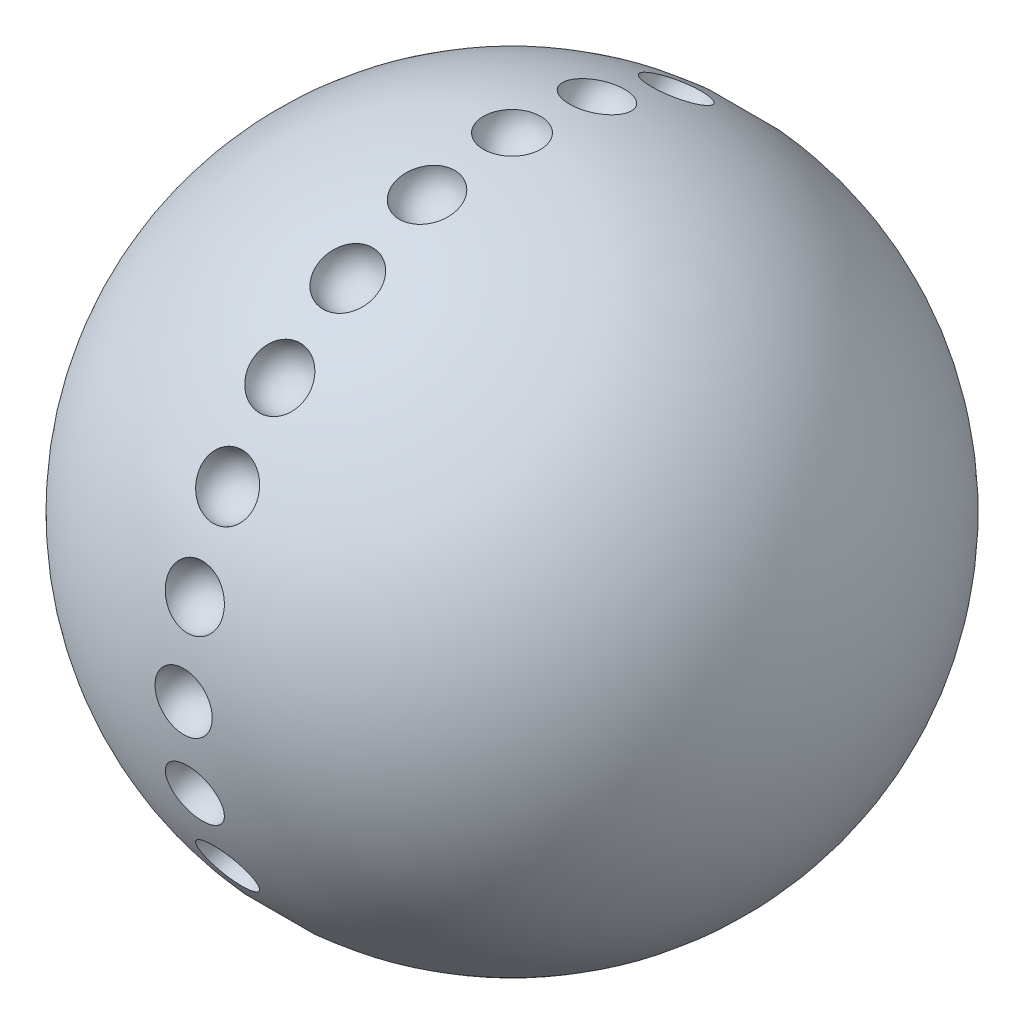
ISO-10303-21;
HEADER;
FILE_DESCRIPTION(('STEP AP214'),'2;1');
FILE_NAME('part.step','',(''),(''),'','','');
FILE_SCHEMA(('AUTOMOTIVE_DESIGN { 1 0 10303 214 1 1 1 1 }'));
ENDSEC;
DATA;
#1=APPLICATION_CONTEXT('core data for automotive mechanical design processes');
#2=APPLICATION_PROTOCOL_DEFINITION('international standard','automotive_design',2000,#1);
#3=PRODUCT_CONTEXT('',#1,'mechanical');
#4=PRODUCT('Part','Part','',(#3));
#5=PRODUCT_RELATED_PRODUCT_CATEGORY('part','',(#4));
#6=PRODUCT_DEFINITION_FORMATION('','',#4);
#7=PRODUCT_DEFINITION_CONTEXT('part definition',#1,'design');
#8=PRODUCT_DEFINITION('design','',#6,#7);
#9=PRODUCT_DEFINITION_SHAPE('','',#8);
#10=(LENGTH_UNIT() NAMED_UNIT(*) SI_UNIT(.MILLI.,.METRE.));
#11=(NAMED_UNIT(*) PLANE_ANGLE_UNIT() SI_UNIT($,.RADIAN.));
#12=(NAMED_UNIT(*) SI_UNIT($,.STERADIAN.) SOLID_ANGLE_UNIT());
#13=UNCERTAINTY_MEASURE_WITH_UNIT(LENGTH_MEASURE(1.E-05),#10,'distance_accuracy_value','');
#14=(GEOMETRIC_REPRESENTATION_CONTEXT(3) GLOBAL_UNCERTAINTY_ASSIGNED_CONTEXT((#13)) GLOBAL_UNIT_ASSIGNED_CONTEXT((#10,
#11,#12)) REPRESENTATION_CONTEXT('',''));
#15=CARTESIAN_POINT('',(0.,0.,0.));
#16=DIRECTION('',(0.,0.,1.));
#17=DIRECTION('',(1.,0.,0.));
#18=AXIS2_PLACEMENT_3D('',#15,#16,#17);
#19=CARTESIAN_POINT('',(0.,0.,0.));
#20=DIRECTION('',(0.,1.,0.));
#21=DIRECTION('',(1.,0.,0.));
#22=AXIS2_PLACEMENT_3D('',#19,#20,#21);
#23=SPHERICAL_SURFACE('',#22,77.4494445270297);
#24=CARTESIAN_POINT('',(0.,-19.9696423745412,-74.5277199507723));
#25=DIRECTION('',(0.,-0.258819045102508,-0.965925826289072));
#26=DIRECTION('',(0.,0.965925826289072,-0.258819045102508));
#27=AXIS2_PLACEMENT_3D('',#24,#25,#26);
#28=CIRCLE('',#27,6.72672282152599);
#29=CARTESIAN_POINT('',(0.,-13.4721270749412,-76.2687239281089));
#30=VERTEX_POINT('',#29);
#31=EDGE_CURVE('E40',#30,#30,#28,.F.);
#32=ORIENTED_EDGE('',*,*,#31,.T.);
#33=EDGE_LOOP('',(#32));
#34=FACE_BOUND('',#33,.T.);
#35=CARTESIAN_POINT('',(0.,-38.578386622653,-66.8197257044724));
#36=DIRECTION('',(0.,-0.499999999999989,-0.866025403784445));
#37=DIRECTION('',(0.,0.866025403784445,-0.499999999999989));
#38=AXIS2_PLACEMENT_3D('',#35,#36,#37);
#39=CIRCLE('',#38,6.72672282152599);
#40=CARTESIAN_POINT('',(0.,-32.7528737749949,-70.1830871152353));
#41=VERTEX_POINT('',#40);
#42=EDGE_CURVE('E132',#41,#41,#39,.F.);
#43=ORIENTED_EDGE('',*,*,#42,.T.);
#44=EDGE_LOOP('',(#43));
#45=FACE_BOUND('',#44,.T.);
#46=CARTESIAN_POINT('',(0.,-54.5580775762291,-54.5580775762305));
#47=DIRECTION('',(0.,-0.707106781186539,-0.707106781186556));
#48=DIRECTION('',(0.,0.707106781186556,-0.707106781186539));
#49=AXIS2_PLACEMENT_3D('',#46,#47,#48);
#50=CIRCLE('',#49,6.72672282152599);
#51=CARTESIAN_POINT('',(0.,-49.8015662539658,-59.3145888984937));
#52=VERTEX_POINT('',#51);
#53=EDGE_CURVE('E129',#52,#52,#50,.F.);
#54=ORIENTED_EDGE('',*,*,#53,.T.);
#55=EDGE_LOOP('',(#54));
#56=FACE_BOUND('',#55,.T.);
#57=CARTESIAN_POINT('',(0.,-66.8197257044715,-38.5783866226546));
#58=DIRECTION('',(0.,-0.866025403784433,-0.50000000000001));
#59=DIRECTION('',(0.,0.50000000000001,-0.866025403784433));
#60=AXIS2_PLACEMENT_3D('',#57,#58,#59);
#61=CIRCLE('',#60,6.72672282152599);
#62=CARTESIAN_POINT('',(0.,-63.4563642937084,-44.4038994703126));
#63=VERTEX_POINT('',#62);
#64=EDGE_CURVE('E125',#63,#63,#61,.F.);
#65=ORIENTED_EDGE('',*,*,#64,.T.);
#66=EDGE_LOOP('',(#65));
#67=FACE_BOUND('',#66,.T.);
#68=CARTESIAN_POINT('',(0.,-74.5277199507718,-19.9696423745431));
#69=DIRECTION('',(0.,-0.965925826289065,-0.258819045102531));
#70=DIRECTION('',(0.,0.258819045102532,-0.965925826289066));
#71=AXIS2_PLACEMENT_3D('',#68,#69,#70);
#72=CIRCLE('',#71,6.72672282152599);
#73=CARTESIAN_POINT('',(0.,-72.7867159734351,-26.4671576741431));
#74=VERTEX_POINT('',#73);
#75=EDGE_CURVE('E121',#74,#74,#72,.F.);
#76=ORIENTED_EDGE('',*,*,#75,.T.);
#77=EDGE_LOOP('',(#76));
#78=FACE_BOUND('',#77,.T.);
#79=CARTESIAN_POINT('',(0.,-77.1567732453076,-8.08174301854028E-13));
#80=DIRECTION('',(0.,-1.,0.));
#81=DIRECTION('',(0.,0.,-1.));
#82=AXIS2_PLACEMENT_3D('',#79,#80,#81);
#83=CIRCLE('',#82,6.72672282152599);
#84=CARTESIAN_POINT('',(0.,-77.1567732453075,-6.7267228215268));
#85=VERTEX_POINT('',#84);
#86=EDGE_CURVE('E117',#85,#85,#83,.F.);
#87=ORIENTED_EDGE('',*,*,#86,.T.);
#88=EDGE_LOOP('',(#87));
#89=FACE_BOUND('',#88,.T.);
#90=CARTESIAN_POINT('',(0.,-74.5277199507723,19.9696423745415));
#91=DIRECTION('',(0.,-0.965925826289071,0.258819045102511));
#92=DIRECTION('',(0.,-0.258819045102511,-0.965925826289071));
#93=AXIS2_PLACEMENT_3D('',#90,#91,#92);
#94=CIRCLE('',#93,6.72672282152599);
#95=CARTESIAN_POINT('',(0.,-76.2687239281089,13.4721270749415));
#96=VERTEX_POINT('',#95);
#97=EDGE_CURVE('E113',#96,#96,#94,.F.);
#98=ORIENTED_EDGE('',*,*,#97,.T.);
#99=EDGE_LOOP('',(#98));
#100=FACE_BOUND('',#99,.T.);
#101=CARTESIAN_POINT('',(0.,-66.8197257044723,38.5783866226532));
#102=DIRECTION('',(0.,-0.866025403784443,0.499999999999992));
#103=DIRECTION('',(0.,-0.499999999999992,-0.866025403784443));
#104=AXIS2_PLACEMENT_3D('',#101,#102,#103);
#105=CIRCLE('',#104,6.72672282152599);
#106=CARTESIAN_POINT('',(0.,-70.1830871152352,32.7528737749951));
#107=VERTEX_POINT('',#106);
#108=EDGE_CURVE('E109',#107,#107,#105,.F.);
#109=ORIENTED_EDGE('',*,*,#108,.T.);
#110=EDGE_LOOP('',(#109));
#111=FACE_BOUND('',#110,.T.);
#112=CARTESIAN_POINT('',(0.,-54.5580775762303,54.5580775762293));
#113=DIRECTION('',(0.,-0.707106781186554,0.707106781186541));
#114=DIRECTION('',(0.,-0.707106781186541,-0.707106781186554));
#115=AXIS2_PLACEMENT_3D('',#112,#113,#114);
#116=CIRCLE('',#115,6.72672282152599);
#117=CARTESIAN_POINT('',(0.,-59.3145888984936,49.801566253966));
#118=VERTEX_POINT('',#117);
#119=EDGE_CURVE('E105',#118,#118,#116,.F.);
#120=ORIENTED_EDGE('',*,*,#119,.T.);
#121=EDGE_LOOP('',(#120));
#122=FACE_BOUND('',#121,.T.);
#123=CARTESIAN_POINT('',(0.,-38.5783866226543,66.8197257044716));
#124=DIRECTION('',(0.,-0.500000000000007,0.866025403784434));
#125=DIRECTION('',(0.,-0.866025403784435,-0.500000000000007));
#126=AXIS2_PLACEMENT_3D('',#123,#124,#125);
#127=CIRCLE('',#126,6.72672282152612);
#128=CARTESIAN_POINT('',(0.,-44.4038994703125,63.4563642937085));
#129=VERTEX_POINT('',#128);
#130=EDGE_CURVE('E101',#129,#129,#127,.F.);
#131=ORIENTED_EDGE('',*,*,#130,.T.);
#132=EDGE_LOOP('',(#131));
#133=FACE_BOUND('',#132,.T.);
#134=CARTESIAN_POINT('',(0.,-19.9696423745428,74.5277199507719));
#135=DIRECTION('',(0.,-0.258819045102528,0.965925826289066));
#136=DIRECTION('',(0.,-0.965925826289066,-0.258819045102528));
#137=AXIS2_PLACEMENT_3D('',#134,#135,#136);
#138=CIRCLE('',#137,6.72672282152599);
#139=CARTESIAN_POINT('',(0.,-26.4671576741428,72.7867159734351));
#140=VERTEX_POINT('',#139);
#141=EDGE_CURVE('E97',#140,#140,#138,.F.);
#142=ORIENTED_EDGE('',*,*,#141,.T.);
#143=EDGE_LOOP('',(#142));
#144=FACE_BOUND('',#143,.T.);
#145=CARTESIAN_POINT('',(0.,0.,77.1567732453076));
#146=DIRECTION('',(0.,0.,1.));
#147=DIRECTION('',(1.,0.,0.));
#148=AXIS2_PLACEMENT_3D('',#145,#146,#147);
#149=CIRCLE('',#148,6.72672282152599);
#150=CARTESIAN_POINT('',(6.72672282152599,0.,77.1567732453076));
#151=VERTEX_POINT('',#150);
#152=EDGE_CURVE('E93',#151,#151,#149,.F.);
#153=ORIENTED_EDGE('',*,*,#152,.T.);
#154=EDGE_LOOP('',(#153));
#155=FACE_BOUND('',#154,.T.);
#156=CARTESIAN_POINT('',(0.,19.9696423745418,74.5277199507722));
#157=DIRECTION('',(0.,0.258819045102515,0.96592582628907));
#158=DIRECTION('',(0.,-0.96592582628907,0.258819045102515));
#159=AXIS2_PLACEMENT_3D('',#156,#157,#158);
#160=CIRCLE('',#159,6.72672282152599);
#161=CARTESIAN_POINT('',(0.,13.4721270749417,76.2687239281088));
#162=VERTEX_POINT('',#161);
#163=EDGE_CURVE('E89',#162,#162,#160,.F.);
#164=ORIENTED_EDGE('',*,*,#163,.T.);
#165=EDGE_LOOP('',(#164));
#166=FACE_BOUND('',#165,.T.);
#167=CARTESIAN_POINT('',(0.,38.5783866226534,66.8197257044721));
#168=DIRECTION('',(0.,0.499999999999995,0.866025403784442));
#169=DIRECTION('',(0.,-0.866025403784442,0.499999999999995));
#170=AXIS2_PLACEMENT_3D('',#167,#168,#169);
#171=CIRCLE('',#170,6.72672282152599);
#172=CARTESIAN_POINT('',(0.,32.7528737749954,70.1830871152351));
#173=VERTEX_POINT('',#172);
#174=EDGE_CURVE('E85',#173,#173,#171,.F.);
#175=ORIENTED_EDGE('',*,*,#174,.T.);
#176=EDGE_LOOP('',(#175));
#177=FACE_BOUND('',#176,.T.);
#178=CARTESIAN_POINT('',(0.,54.5580775762295,54.5580775762301));
#179=DIRECTION('',(0.,0.707106781186544,0.707106781186551));
#180=DIRECTION('',(0.,-0.707106781186551,0.707106781186544));
#181=AXIS2_PLACEMENT_3D('',#178,#179,#180);
#182=CIRCLE('',#181,6.72672282152599);
#183=CARTESIAN_POINT('',(0.,49.8015662539662,59.3145888984934));
#184=VERTEX_POINT('',#183);
#185=EDGE_CURVE('E81',#184,#184,#182,.F.);
#186=ORIENTED_EDGE('',*,*,#185,.T.);
#187=EDGE_LOOP('',(#186));
#188=FACE_BOUND('',#187,.T.);
#189=CARTESIAN_POINT('',(0.,66.8197257044717,38.5783866226541));
#190=DIRECTION('',(0.,0.866025403784436,0.500000000000004));
#191=DIRECTION('',(0.,-0.500000000000004,0.866025403784436));
#192=AXIS2_PLACEMENT_3D('',#189,#190,#191);
#193=CIRCLE('',#192,6.72672282152612);
#194=CARTESIAN_POINT('',(0.,63.4563642937086,44.4038994703122));
#195=VERTEX_POINT('',#194);
#196=EDGE_CURVE('E77',#195,#195,#193,.F.);
#197=ORIENTED_EDGE('',*,*,#196,.T.);
#198=EDGE_LOOP('',(#197));
#199=FACE_BOUND('',#198,.T.);
#200=CARTESIAN_POINT('',(0.,74.5277199507719,19.9696423745425));
#201=DIRECTION('',(0.,0.965925826289067,0.258819045102525));
#202=DIRECTION('',(0.,-0.258819045102525,0.965925826289067));
#203=AXIS2_PLACEMENT_3D('',#200,#201,#202);
#204=CIRCLE('',#203,6.72672282152612);
#205=CARTESIAN_POINT('',(0.,72.7867159734352,26.4671576741427));
#206=VERTEX_POINT('',#205);
#207=EDGE_CURVE('E73',#206,#206,#204,.F.);
#208=ORIENTED_EDGE('',*,*,#207,.T.);
#209=EDGE_LOOP('',(#208));
#210=FACE_BOUND('',#209,.T.);
#211=CARTESIAN_POINT('',(0.,77.1567732453076,2.69391433951343E-13));
#212=DIRECTION('',(0.,1.,0.));
#213=DIRECTION('',(0.,0.,1.));
#214=AXIS2_PLACEMENT_3D('',#211,#212,#213);
#215=CIRCLE('',#214,6.72672282152599);
#216=CARTESIAN_POINT('',(0.,77.1567732453076,6.72672282152626));
#217=VERTEX_POINT('',#216);
#218=EDGE_CURVE('E69',#217,#217,#215,.F.);
#219=ORIENTED_EDGE('',*,*,#218,.T.);
#220=EDGE_LOOP('',(#219));
#221=FACE_BOUND('',#220,.T.);
#222=CARTESIAN_POINT('',(0.,74.5277199507721,-19.969642374542));
#223=DIRECTION('',(0.,0.965925826289069,-0.258819045102518));
#224=DIRECTION('',(0.,0.258819045102518,0.965925826289069));
#225=AXIS2_PLACEMENT_3D('',#222,#223,#224);
#226=CIRCLE('',#225,6.72672282152612);
#227=CARTESIAN_POINT('',(0.,76.2687239281088,-13.4721270749419));
#228=VERTEX_POINT('',#227);
#229=EDGE_CURVE('E65',#228,#228,#226,.F.);
#230=ORIENTED_EDGE('',*,*,#229,.T.);
#231=EDGE_LOOP('',(#230));
#232=FACE_BOUND('',#231,.T.);
#233=CARTESIAN_POINT('',(0.,66.819725704472,-38.5783866226537));
#234=DIRECTION('',(0.,0.86602540378444,-0.499999999999998));
#235=DIRECTION('',(0.,0.499999999999998,0.86602540378444));
#236=AXIS2_PLACEMENT_3D('',#233,#234,#235);
#237=CIRCLE('',#236,6.72672282152599);
#238=CARTESIAN_POINT('',(0.,70.183087115235,-32.7528737749956));
#239=VERTEX_POINT('',#238);
#240=EDGE_CURVE('E61',#239,#239,#237,.F.);
#241=ORIENTED_EDGE('',*,*,#240,.T.);
#242=EDGE_LOOP('',(#241));
#243=FACE_BOUND('',#242,.T.);
#244=CARTESIAN_POINT('',(0.,54.5580775762299,-54.5580775762297));
#245=DIRECTION('',(0.,0.707106781186549,-0.707106781186546));
#246=DIRECTION('',(0.,0.707106781186546,0.707106781186549));
#247=AXIS2_PLACEMENT_3D('',#244,#245,#246);
#248=CIRCLE('',#247,6.72672282152599);
#249=CARTESIAN_POINT('',(0.,59.3145888984932,-49.8015662539664));
#250=VERTEX_POINT('',#249);
#251=EDGE_CURVE('E57',#250,#250,#248,.F.);
#252=ORIENTED_EDGE('',*,*,#251,.T.);
#253=EDGE_LOOP('',(#252));
#254=FACE_BOUND('',#253,.T.);
#255=CARTESIAN_POINT('',(0.,38.5783866226539,-66.8197257044718));
#256=DIRECTION('',(0.,0.500000000000001,-0.866025403784438));
#257=DIRECTION('',(0.,0.866025403784438,0.500000000000001));
#258=AXIS2_PLACEMENT_3D('',#255,#256,#257);
#259=CIRCLE('',#258,6.72672282152599);
#260=CARTESIAN_POINT('',(0.,44.4038994703119,-63.4563642937089));
#261=VERTEX_POINT('',#260);
#262=EDGE_CURVE('E51',#261,#261,#259,.F.);
#263=ORIENTED_EDGE('',*,*,#262,.T.);
#264=EDGE_LOOP('',(#263));
#265=FACE_BOUND('',#264,.T.);
#266=CARTESIAN_POINT('',(0.,19.9696423745423,-74.527719950772));
#267=DIRECTION('',(0.,0.258819045102521,-0.965925826289068));
#268=DIRECTION('',(0.,0.965925826289068,0.258819045102521));
#269=AXIS2_PLACEMENT_3D('',#266,#267,#268);
#270=CIRCLE('',#269,6.72672282152599);
#271=CARTESIAN_POINT('',(0.,26.4671576741423,-72.7867159734353));
#272=VERTEX_POINT('',#271);
#273=EDGE_CURVE('E45',#272,#272,#270,.F.);
#274=ORIENTED_EDGE('',*,*,#273,.T.);
#275=EDGE_LOOP('',(#274));
#276=FACE_BOUND('',#275,.T.);
#277=CARTESIAN_POINT('',(0.,0.,-77.1567732453076));
#278=DIRECTION('',(0.,0.,-1.));
#279=DIRECTION('',(-1.,0.,0.));
#280=AXIS2_PLACEMENT_3D('',#277,#278,#279);
#281=CIRCLE('',#280,6.72672282152599);
#282=CARTESIAN_POINT('',(-6.72672282152599,0.,-77.1567732453076));
#283=VERTEX_POINT('',#282);
#284=EDGE_CURVE('E10',#283,#283,#281,.F.);
#285=ORIENTED_EDGE('',*,*,#284,.T.);
#286=EDGE_LOOP('',(#285));
#287=FACE_BOUND('',#286,.T.);
#288=ADVANCED_FACE('F37',(#34,#45,#56,#67,#78,#89,#100,#111,#122,#133,#144,#155,#166,#177,#188,
#199,#210,#221,#232,#243,#254,#265,#276,#287),#23,.T.);
#289=CARTESIAN_POINT('',(0.,0.,-77.4494445270297));
#290=DIRECTION('',(-1.,0.,0.));
#291=DIRECTION('',(0.,0.,-1.));
#292=AXIS2_PLACEMENT_3D('',#289,#290,#291);
#293=SPHERICAL_SURFACE('',#292,6.73308669161355);
#294=CARTESIAN_POINT('',(0.,0.,-77.4494445270297));
#295=DIRECTION('',(0.,0.,-1.));
#296=DIRECTION('',(-1.,0.,0.));
#297=AXIS2_PLACEMENT_3D('',#294,#295,#296);
#298=SPHERICAL_SURFACE('',#297,6.73308669161355);
#299=ORIENTED_EDGE('',*,*,#284,.F.);
#300=EDGE_LOOP('',(#299));
#301=FACE_BOUND('',#300,.T.);
#302=ADVANCED_FACE('F153',(#301),#298,.F.);
#303=CARTESIAN_POINT('',(0.,20.0453912762065,-74.8104187004005));
#304=DIRECTION('',(-1.,0.,0.));
#305=DIRECTION('',(0.,0.258819045102521,-0.965925826289068));
#306=AXIS2_PLACEMENT_3D('',#303,#304,#305);
#307=SPHERICAL_SURFACE('',#306,6.73308669161355);
#308=CARTESIAN_POINT('',(0.,20.0453912762065,-74.8104187004005));
#309=DIRECTION('',(0.,0.258819045102521,-0.965925826289068));
#310=DIRECTION('',(0.,0.965925826289068,0.258819045102521));
#311=AXIS2_PLACEMENT_3D('',#308,#309,#310);
#312=SPHERICAL_SURFACE('',#311,6.73308669161355);
#313=ORIENTED_EDGE('',*,*,#273,.F.);
#314=EDGE_LOOP('',(#313));
#315=FACE_BOUND('',#314,.T.);
#316=ADVANCED_FACE('F157',(#315),#312,.F.);
#317=CARTESIAN_POINT('',(0.,38.7247222635149,-67.0731864694014));
#318=DIRECTION('',(-1.,0.,0.));
#319=DIRECTION('',(0.,0.500000000000001,-0.866025403784438));
#320=AXIS2_PLACEMENT_3D('',#317,#318,#319);
#321=SPHERICAL_SURFACE('',#320,6.73308669161355);
#322=CARTESIAN_POINT('',(0.,38.7247222635149,-67.0731864694014));
#323=DIRECTION('',(0.,0.500000000000001,-0.866025403784438));
#324=DIRECTION('',(0.,0.866025403784438,0.500000000000001));
#325=AXIS2_PLACEMENT_3D('',#322,#323,#324);
#326=SPHERICAL_SURFACE('',#325,6.73308669161355);
#327=ORIENTED_EDGE('',*,*,#262,.F.);
#328=EDGE_LOOP('',(#327));
#329=FACE_BOUND('',#328,.T.);
#330=ADVANCED_FACE('F162',(#329),#326,.F.);
#331=CARTESIAN_POINT('',(0.,54.7650274241942,-54.765027424194));
#332=DIRECTION('',(-1.,0.,0.));
#333=DIRECTION('',(0.,0.707106781186549,-0.707106781186546));
#334=AXIS2_PLACEMENT_3D('',#331,#332,#333);
#335=SPHERICAL_SURFACE('',#334,6.73308669161355);
#336=CARTESIAN_POINT('',(0.,54.7650274241942,-54.765027424194));
#337=DIRECTION('',(0.,0.707106781186549,-0.707106781186546));
#338=DIRECTION('',(0.,0.707106781186546,0.707106781186549));
#339=AXIS2_PLACEMENT_3D('',#336,#337,#338);
#340=SPHERICAL_SURFACE('',#339,6.73308669161355);
#341=ORIENTED_EDGE('',*,*,#251,.F.);
#342=EDGE_LOOP('',(#341));
#343=FACE_BOUND('',#342,.T.);
#344=ADVANCED_FACE('F168',(#343),#340,.F.);
#345=CARTESIAN_POINT('',(0.,67.0731864694015,-38.7247222635147));
#346=DIRECTION('',(-1.,0.,0.));
#347=DIRECTION('',(0.,0.86602540378444,-0.499999999999998));
#348=AXIS2_PLACEMENT_3D('',#345,#346,#347);
#349=SPHERICAL_SURFACE('',#348,6.73308669161355);
#350=CARTESIAN_POINT('',(0.,67.0731864694015,-38.7247222635147));
#351=DIRECTION('',(0.,0.86602540378444,-0.499999999999998));
#352=DIRECTION('',(0.,0.499999999999998,0.86602540378444));
#353=AXIS2_PLACEMENT_3D('',#350,#351,#352);
#354=SPHERICAL_SURFACE('',#353,6.73308669161355);
#355=ORIENTED_EDGE('',*,*,#240,.F.);
#356=EDGE_LOOP('',(#355));
#357=FACE_BOUND('',#356,.T.);
#358=ADVANCED_FACE('F172',(#357),#354,.F.);
#359=CARTESIAN_POINT('',(0.,74.8104187004006,-20.0453912762063));
#360=DIRECTION('',(-1.,0.,0.));
#361=DIRECTION('',(0.,0.965925826289069,-0.258819045102518));
#362=AXIS2_PLACEMENT_3D('',#359,#360,#361);
#363=SPHERICAL_SURFACE('',#362,6.73308669161355);
#364=CARTESIAN_POINT('',(0.,74.8104187004006,-20.0453912762063));
#365=DIRECTION('',(0.,0.965925826289069,-0.258819045102518));
#366=DIRECTION('',(0.,0.258819045102518,0.965925826289069));
#367=AXIS2_PLACEMENT_3D('',#364,#365,#366);
#368=SPHERICAL_SURFACE('',#367,6.73308669161355);
#369=ORIENTED_EDGE('',*,*,#229,.F.);
#370=EDGE_LOOP('',(#369));
#371=FACE_BOUND('',#370,.T.);
#372=ADVANCED_FACE('F176',(#371),#368,.F.);
#373=CARTESIAN_POINT('',(0.,77.4494445270297,2.70413290269891E-13));
#374=DIRECTION('',(-1.,0.,0.));
#375=DIRECTION('',(0.,1.,0.));
#376=AXIS2_PLACEMENT_3D('',#373,#374,#375);
#377=SPHERICAL_SURFACE('',#376,6.73308669161355);
#378=CARTESIAN_POINT('',(0.,77.4494445270297,2.70413290269891E-13));
#379=DIRECTION('',(0.,1.,0.));
#380=DIRECTION('',(0.,0.,1.));
#381=AXIS2_PLACEMENT_3D('',#378,#379,#380);
#382=SPHERICAL_SURFACE('',#381,6.73308669161355);
#383=ORIENTED_EDGE('',*,*,#218,.F.);
#384=EDGE_LOOP('',(#383));
#385=FACE_BOUND('',#384,.T.);
#386=ADVANCED_FACE('F180',(#385),#382,.F.);
#387=CARTESIAN_POINT('',(0.,74.8104187004005,20.0453912762068));
#388=DIRECTION('',(-1.,0.,0.));
#389=DIRECTION('',(0.,0.965925826289067,0.258819045102525));
#390=AXIS2_PLACEMENT_3D('',#387,#388,#389);
#391=SPHERICAL_SURFACE('',#390,6.73308669161355);
#392=CARTESIAN_POINT('',(0.,74.8104187004005,20.0453912762068));
#393=DIRECTION('',(0.,0.965925826289067,0.258819045102525));
#394=DIRECTION('',(0.,-0.258819045102525,0.965925826289067));
#395=AXIS2_PLACEMENT_3D('',#392,#393,#394);
#396=SPHERICAL_SURFACE('',#395,6.73308669161355);
#397=ORIENTED_EDGE('',*,*,#207,.F.);
#398=EDGE_LOOP('',(#397));
#399=FACE_BOUND('',#398,.T.);
#400=ADVANCED_FACE('F184',(#399),#396,.F.);
#401=CARTESIAN_POINT('',(0.,67.0731864694012,38.7247222635152));
#402=DIRECTION('',(-1.,0.,0.));
#403=DIRECTION('',(0.,0.866025403784436,0.500000000000004));
#404=AXIS2_PLACEMENT_3D('',#401,#402,#403);
#405=SPHERICAL_SURFACE('',#404,6.73308669161355);
#406=CARTESIAN_POINT('',(0.,67.0731864694012,38.7247222635152));
#407=DIRECTION('',(0.,0.866025403784436,0.500000000000004));
#408=DIRECTION('',(0.,-0.500000000000004,0.866025403784436));
#409=AXIS2_PLACEMENT_3D('',#406,#407,#408);
#410=SPHERICAL_SURFACE('',#409,6.73308669161355);
#411=ORIENTED_EDGE('',*,*,#196,.F.);
#412=EDGE_LOOP('',(#411));
#413=FACE_BOUND('',#412,.T.);
#414=ADVANCED_FACE('F188',(#413),#410,.F.);
#415=CARTESIAN_POINT('',(0.,54.7650274241938,54.7650274241944));
#416=DIRECTION('',(-1.,0.,0.));
#417=DIRECTION('',(0.,0.707106781186544,0.707106781186551));
#418=AXIS2_PLACEMENT_3D('',#415,#416,#417);
#419=SPHERICAL_SURFACE('',#418,6.73308669161355);
#420=CARTESIAN_POINT('',(0.,54.7650274241938,54.7650274241944));
#421=DIRECTION('',(0.,0.707106781186544,0.707106781186551));
#422=DIRECTION('',(0.,-0.707106781186551,0.707106781186544));
#423=AXIS2_PLACEMENT_3D('',#420,#421,#422);
#424=SPHERICAL_SURFACE('',#423,6.73308669161355);
#425=ORIENTED_EDGE('',*,*,#185,.F.);
#426=EDGE_LOOP('',(#425));
#427=FACE_BOUND('',#426,.T.);
#428=ADVANCED_FACE('F192',(#427),#424,.F.);
#429=CARTESIAN_POINT('',(0.,38.7247222635145,67.0731864694016));
#430=DIRECTION('',(-1.,0.,0.));
#431=DIRECTION('',(0.,0.499999999999995,0.866025403784442));
#432=AXIS2_PLACEMENT_3D('',#429,#430,#431);
#433=SPHERICAL_SURFACE('',#432,6.73308669161355);
#434=CARTESIAN_POINT('',(0.,38.7247222635145,67.0731864694016));
#435=DIRECTION('',(0.,0.499999999999995,0.866025403784442));
#436=DIRECTION('',(0.,-0.866025403784442,0.499999999999995));
#437=AXIS2_PLACEMENT_3D('',#434,#435,#436);
#438=SPHERICAL_SURFACE('',#437,6.73308669161355);
#439=ORIENTED_EDGE('',*,*,#174,.F.);
#440=EDGE_LOOP('',(#439));
#441=FACE_BOUND('',#440,.T.);
#442=ADVANCED_FACE('F196',(#441),#438,.F.);
#443=CARTESIAN_POINT('',(0.,20.045391276206,74.8104187004007));
#444=DIRECTION('',(-1.,0.,0.));
#445=DIRECTION('',(0.,0.258819045102515,0.96592582628907));
#446=AXIS2_PLACEMENT_3D('',#443,#444,#445);
#447=SPHERICAL_SURFACE('',#446,6.73308669161355);
#448=CARTESIAN_POINT('',(0.,20.045391276206,74.8104187004007));
#449=DIRECTION('',(0.,0.258819045102515,0.96592582628907));
#450=DIRECTION('',(0.,-0.96592582628907,0.258819045102515));
#451=AXIS2_PLACEMENT_3D('',#448,#449,#450);
#452=SPHERICAL_SURFACE('',#451,6.73308669161355);
#453=ORIENTED_EDGE('',*,*,#163,.F.);
#454=EDGE_LOOP('',(#453));
#455=FACE_BOUND('',#454,.T.);
#456=ADVANCED_FACE('F200',(#455),#452,.F.);
#457=CARTESIAN_POINT('',(0.,0.,77.4494445270297));
#458=DIRECTION('',(-1.,0.,0.));
#459=DIRECTION('',(0.,0.,1.));
#460=AXIS2_PLACEMENT_3D('',#457,#458,#459);
#461=SPHERICAL_SURFACE('',#460,6.73308669161355);
#462=CARTESIAN_POINT('',(0.,0.,77.4494445270297));
#463=DIRECTION('',(0.,0.,1.));
#464=DIRECTION('',(1.,0.,0.));
#465=AXIS2_PLACEMENT_3D('',#462,#463,#464);
#466=SPHERICAL_SURFACE('',#465,6.73308669161355);
#467=ORIENTED_EDGE('',*,*,#152,.F.);
#468=EDGE_LOOP('',(#467));
#469=FACE_BOUND('',#468,.T.);
#470=ADVANCED_FACE('F204',(#469),#466,.F.);
#471=CARTESIAN_POINT('',(0.,-20.0453912762071,74.8104187004004));
#472=DIRECTION('',(-1.,0.,0.));
#473=DIRECTION('',(0.,-0.258819045102528,0.965925826289066));
#474=AXIS2_PLACEMENT_3D('',#471,#472,#473);
#475=SPHERICAL_SURFACE('',#474,6.73308669161355);
#476=CARTESIAN_POINT('',(0.,-20.0453912762071,74.8104187004004));
#477=DIRECTION('',(0.,-0.258819045102528,0.965925826289066));
#478=DIRECTION('',(0.,-0.965925826289066,-0.258819045102528));
#479=AXIS2_PLACEMENT_3D('',#476,#477,#478);
#480=SPHERICAL_SURFACE('',#479,6.73308669161355);
#481=ORIENTED_EDGE('',*,*,#141,.F.);
#482=EDGE_LOOP('',(#481));
#483=FACE_BOUND('',#482,.T.);
#484=ADVANCED_FACE('F208',(#483),#480,.F.);
#485=CARTESIAN_POINT('',(0.,-38.7247222635154,67.0731864694011));
#486=DIRECTION('',(-1.,0.,0.));
#487=DIRECTION('',(0.,-0.500000000000007,0.866025403784435));
#488=AXIS2_PLACEMENT_3D('',#485,#486,#487);
#489=SPHERICAL_SURFACE('',#488,6.73308669161355);
#490=CARTESIAN_POINT('',(0.,-38.7247222635154,67.0731864694011));
#491=DIRECTION('',(0.,-0.500000000000007,0.866025403784435));
#492=DIRECTION('',(0.,-0.866025403784434,-0.500000000000007));
#493=AXIS2_PLACEMENT_3D('',#490,#491,#492);
#494=SPHERICAL_SURFACE('',#493,6.73308669161355);
#495=ORIENTED_EDGE('',*,*,#130,.F.);
#496=EDGE_LOOP('',(#495));
#497=FACE_BOUND('',#496,.T.);
#498=ADVANCED_FACE('F212',(#497),#494,.F.);
#499=CARTESIAN_POINT('',(0.,-54.7650274241945,54.7650274241936));
#500=DIRECTION('',(-1.,0.,0.));
#501=DIRECTION('',(0.,-0.707106781186554,0.707106781186541));
#502=AXIS2_PLACEMENT_3D('',#499,#500,#501);
#503=SPHERICAL_SURFACE('',#502,6.73308669161355);
#504=CARTESIAN_POINT('',(0.,-54.7650274241945,54.7650274241936));
#505=DIRECTION('',(0.,-0.707106781186554,0.707106781186541));
#506=DIRECTION('',(0.,-0.707106781186541,-0.707106781186554));
#507=AXIS2_PLACEMENT_3D('',#504,#505,#506);
#508=SPHERICAL_SURFACE('',#507,6.73308669161355);
#509=ORIENTED_EDGE('',*,*,#119,.F.);
#510=EDGE_LOOP('',(#509));
#511=FACE_BOUND('',#510,.T.);
#512=ADVANCED_FACE('F216',(#511),#508,.F.);
#513=CARTESIAN_POINT('',(0.,-67.0731864694018,38.7247222635142));
#514=DIRECTION('',(-1.,0.,0.));
#515=DIRECTION('',(0.,-0.866025403784443,0.499999999999992));
#516=AXIS2_PLACEMENT_3D('',#513,#514,#515);
#517=SPHERICAL_SURFACE('',#516,6.73308669161355);
#518=CARTESIAN_POINT('',(0.,-67.0731864694018,38.7247222635142));
#519=DIRECTION('',(0.,-0.866025403784443,0.499999999999992));
#520=DIRECTION('',(0.,-0.499999999999992,-0.866025403784443));
#521=AXIS2_PLACEMENT_3D('',#518,#519,#520);
#522=SPHERICAL_SURFACE('',#521,6.73308669161355);
#523=ORIENTED_EDGE('',*,*,#108,.F.);
#524=EDGE_LOOP('',(#523));
#525=FACE_BOUND('',#524,.T.);
#526=ADVANCED_FACE('F220',(#525),#522,.F.);
#527=CARTESIAN_POINT('',(0.,-74.8104187004008,20.0453912762057));
#528=DIRECTION('',(-1.,0.,0.));
#529=DIRECTION('',(0.,-0.965925826289071,0.258819045102511));
#530=AXIS2_PLACEMENT_3D('',#527,#528,#529);
#531=SPHERICAL_SURFACE('',#530,6.73308669161355);
#532=CARTESIAN_POINT('',(0.,-74.8104187004008,20.0453912762057));
#533=DIRECTION('',(0.,-0.965925826289071,0.258819045102511));
#534=DIRECTION('',(0.,-0.258819045102511,-0.965925826289071));
#535=AXIS2_PLACEMENT_3D('',#532,#533,#534);
#536=SPHERICAL_SURFACE('',#535,6.73308669161355);
#537=ORIENTED_EDGE('',*,*,#97,.F.);
#538=EDGE_LOOP('',(#537));
#539=FACE_BOUND('',#538,.T.);
#540=ADVANCED_FACE('F224',(#539),#536,.F.);
#541=CARTESIAN_POINT('',(0.,-77.4494445270297,-8.11239870809672E-13));
#542=DIRECTION('',(-1.,0.,0.));
#543=DIRECTION('',(0.,-1.,0.));
#544=AXIS2_PLACEMENT_3D('',#541,#542,#543);
#545=SPHERICAL_SURFACE('',#544,6.73308669161355);
#546=CARTESIAN_POINT('',(0.,-77.4494445270297,-8.11239870809672E-13));
#547=DIRECTION('',(0.,-1.,0.));
#548=DIRECTION('',(0.,0.,-1.));
#549=AXIS2_PLACEMENT_3D('',#546,#547,#548);
#550=SPHERICAL_SURFACE('',#549,6.73308669161355);
#551=ORIENTED_EDGE('',*,*,#86,.F.);
#552=EDGE_LOOP('',(#551));
#553=FACE_BOUND('',#552,.T.);
#554=ADVANCED_FACE('F228',(#553),#550,.F.);
#555=CARTESIAN_POINT('',(0.,-74.8104187004003,-20.0453912762073));
#556=DIRECTION('',(-1.,0.,0.));
#557=DIRECTION('',(0.,-0.965925826289065,-0.258819045102531));
#558=AXIS2_PLACEMENT_3D('',#555,#556,#557);
#559=SPHERICAL_SURFACE('',#558,6.73308669161355);
#560=CARTESIAN_POINT('',(0.,-74.8104187004003,-20.0453912762073));
#561=DIRECTION('',(0.,-0.965925826289066,-0.258819045102532));
#562=DIRECTION('',(0.,0.258819045102532,-0.965925826289066));
#563=AXIS2_PLACEMENT_3D('',#560,#561,#562);
#564=SPHERICAL_SURFACE('',#563,6.73308669161355);
#565=ORIENTED_EDGE('',*,*,#75,.F.);
#566=EDGE_LOOP('',(#565));
#567=FACE_BOUND('',#566,.T.);
#568=ADVANCED_FACE('F232',(#567),#564,.F.);
#569=CARTESIAN_POINT('',(0.,-67.073186469401,-38.7247222635157));
#570=DIRECTION('',(-1.,0.,0.));
#571=DIRECTION('',(0.,-0.866025403784433,-0.50000000000001));
#572=AXIS2_PLACEMENT_3D('',#569,#570,#571);
#573=SPHERICAL_SURFACE('',#572,6.73308669161355);
#574=CARTESIAN_POINT('',(0.,-67.073186469401,-38.7247222635157));
#575=DIRECTION('',(0.,-0.866025403784433,-0.50000000000001));
#576=DIRECTION('',(0.,0.50000000000001,-0.866025403784433));
#577=AXIS2_PLACEMENT_3D('',#574,#575,#576);
#578=SPHERICAL_SURFACE('',#577,6.73308669161355);
#579=ORIENTED_EDGE('',*,*,#64,.F.);
#580=EDGE_LOOP('',(#579));
#581=FACE_BOUND('',#580,.T.);
#582=ADVANCED_FACE('F236',(#581),#578,.F.);
#583=CARTESIAN_POINT('',(0.,-54.7650274241934,-54.7650274241947));
#584=DIRECTION('',(-1.,0.,0.));
#585=DIRECTION('',(0.,-0.707106781186539,-0.707106781186556));
#586=AXIS2_PLACEMENT_3D('',#583,#584,#585);
#587=SPHERICAL_SURFACE('',#586,6.73308669161355);
#588=CARTESIAN_POINT('',(0.,-54.7650274241934,-54.7650274241947));
#589=DIRECTION('',(0.,-0.707106781186539,-0.707106781186556));
#590=DIRECTION('',(0.,0.707106781186556,-0.707106781186539));
#591=AXIS2_PLACEMENT_3D('',#588,#589,#590);
#592=SPHERICAL_SURFACE('',#591,6.73308669161355);
#593=ORIENTED_EDGE('',*,*,#53,.F.);
#594=EDGE_LOOP('',(#593));
#595=FACE_BOUND('',#594,.T.);
#596=ADVANCED_FACE('F149',(#595),#592,.F.);
#597=CARTESIAN_POINT('',(0.,-38.724722263514,-67.0731864694019));
#598=DIRECTION('',(-1.,0.,0.));
#599=DIRECTION('',(0.,-0.499999999999989,-0.866025403784445));
#600=AXIS2_PLACEMENT_3D('',#597,#598,#599);
#601=SPHERICAL_SURFACE('',#600,6.73308669161355);
#602=CARTESIAN_POINT('',(0.,-38.724722263514,-67.0731864694019));
#603=DIRECTION('',(0.,-0.499999999999989,-0.866025403784445));
#604=DIRECTION('',(0.,0.866025403784445,-0.499999999999989));
#605=AXIS2_PLACEMENT_3D('',#602,#603,#604);
#606=SPHERICAL_SURFACE('',#605,6.73308669161355);
#607=ORIENTED_EDGE('',*,*,#42,.F.);
#608=EDGE_LOOP('',(#607));
#609=FACE_BOUND('',#608,.T.);
#610=ADVANCED_FACE('F144',(#609),#606,.F.);
#611=CARTESIAN_POINT('',(0.,-20.0453912762055,-74.8104187004008));
#612=DIRECTION('',(-1.,0.,0.));
#613=DIRECTION('',(0.,-0.258819045102508,-0.965925826289072));
#614=AXIS2_PLACEMENT_3D('',#611,#612,#613);
#615=SPHERICAL_SURFACE('',#614,6.73308669161355);
#616=CARTESIAN_POINT('',(0.,-20.0453912762055,-74.8104187004008));
#617=DIRECTION('',(0.,-0.258819045102508,-0.965925826289072));
#618=DIRECTION('',(0.,0.965925826289072,-0.258819045102508));
#619=AXIS2_PLACEMENT_3D('',#616,#617,#618);
#620=SPHERICAL_SURFACE('',#619,6.73308669161355);
#621=ORIENTED_EDGE('',*,*,#31,.F.);
#622=EDGE_LOOP('',(#621));
#623=FACE_BOUND('',#622,.T.);
#624=ADVANCED_FACE('F142',(#623),#620,.F.);
#625=CLOSED_SHELL('',(#288,#302,#316,#330,#344,#358,#372,#386,#400,#414,#428,#442,#456,#470,
#484,#498,#512,#526,#540,#554,#568,#582,#596,#610,#624));
#626=MANIFOLD_SOLID_BREP('B2',#625);
#627=ADVANCED_BREP_SHAPE_REPRESENTATION('',(#18,#626),#14);
#628=SHAPE_DEFINITION_REPRESENTATION(#9,#627);
ENDSEC;
END-ISO-10303-21;
